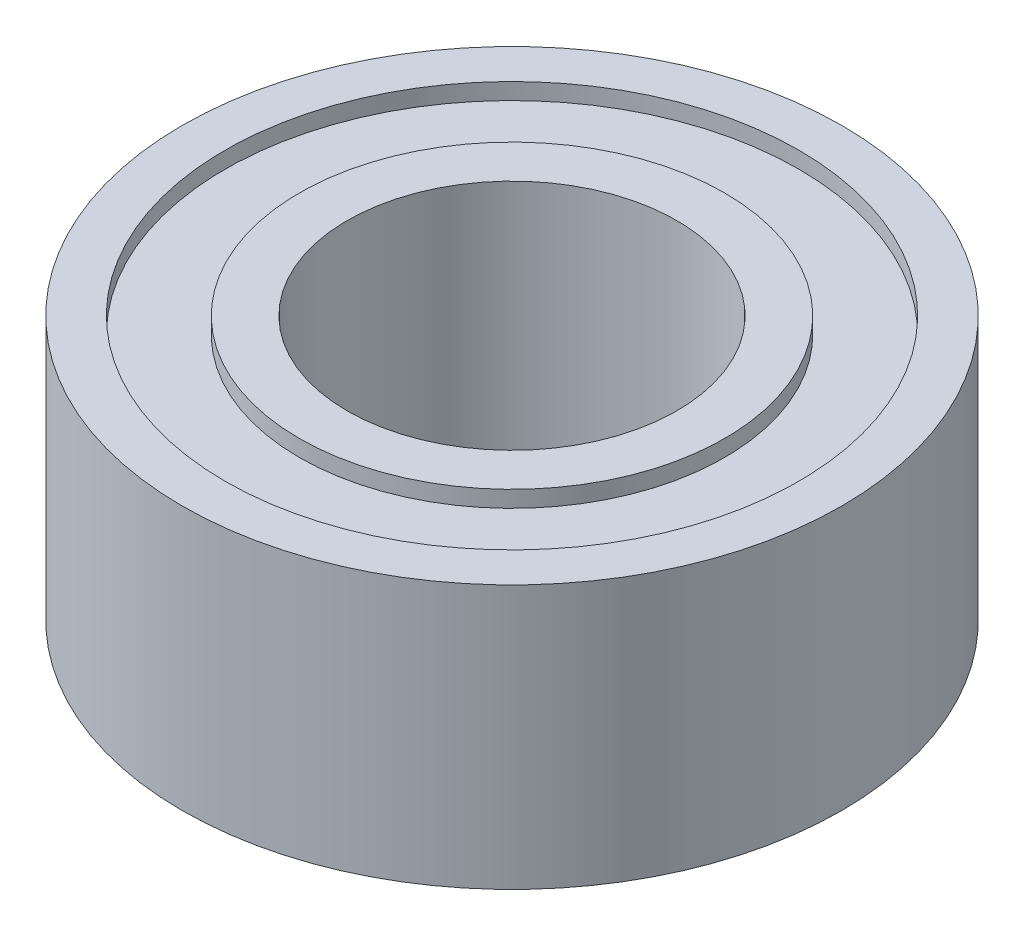
ISO-10303-21;
HEADER;
FILE_DESCRIPTION(('STEP AP214'),'2;1');
FILE_NAME('part.step','',(''),(''),'','','');
FILE_SCHEMA(('AUTOMOTIVE_DESIGN { 1 0 10303 214 1 1 1 1 }'));
ENDSEC;
DATA;
#1=APPLICATION_CONTEXT('core data for automotive mechanical design processes');
#2=APPLICATION_PROTOCOL_DEFINITION('international standard','automotive_design',2000,#1);
#3=PRODUCT_CONTEXT('',#1,'mechanical');
#4=PRODUCT('Part','Part','',(#3));
#5=PRODUCT_RELATED_PRODUCT_CATEGORY('part','',(#4));
#6=PRODUCT_DEFINITION_FORMATION('','',#4);
#7=PRODUCT_DEFINITION_CONTEXT('part definition',#1,'design');
#8=PRODUCT_DEFINITION('design','',#6,#7);
#9=PRODUCT_DEFINITION_SHAPE('','',#8);
#10=(LENGTH_UNIT() NAMED_UNIT(*) SI_UNIT(.MILLI.,.METRE.));
#11=(NAMED_UNIT(*) PLANE_ANGLE_UNIT() SI_UNIT($,.RADIAN.));
#12=(NAMED_UNIT(*) SI_UNIT($,.STERADIAN.) SOLID_ANGLE_UNIT());
#13=UNCERTAINTY_MEASURE_WITH_UNIT(LENGTH_MEASURE(1.E-05),#10,'distance_accuracy_value','');
#14=(GEOMETRIC_REPRESENTATION_CONTEXT(3) GLOBAL_UNCERTAINTY_ASSIGNED_CONTEXT((#13)) GLOBAL_UNIT_ASSIGNED_CONTEXT((#10,
#11,#12)) REPRESENTATION_CONTEXT('',''));
#15=CARTESIAN_POINT('',(0.,0.,0.));
#16=DIRECTION('',(0.,0.,1.));
#17=DIRECTION('',(1.,0.,0.));
#18=AXIS2_PLACEMENT_3D('',#15,#16,#17);
#19=CARTESIAN_POINT('',(0.,0.,0.));
#20=DIRECTION('',(0.,1.,0.));
#21=DIRECTION('',(0.,0.,1.));
#22=AXIS2_PLACEMENT_3D('',#19,#20,#21);
#23=PLANE('',#22);
#24=CARTESIAN_POINT('',(0.,0.,0.));
#25=DIRECTION('',(0.,1.,0.));
#26=DIRECTION('',(0.,0.,1.));
#27=AXIS2_PLACEMENT_3D('',#24,#25,#26);
#28=CIRCLE('',#27,2.5);
#29=CARTESIAN_POINT('',(0.,0.,2.5));
#30=VERTEX_POINT('',#29);
#31=EDGE_CURVE('E52',#30,#30,#28,.T.);
#32=ORIENTED_EDGE('',*,*,#31,.T.);
#33=EDGE_LOOP('',(#32));
#34=FACE_BOUND('',#33,.T.);
#35=CARTESIAN_POINT('',(0.,0.,0.));
#36=DIRECTION('',(0.,-1.,0.));
#37=DIRECTION('',(0.,0.,-1.));
#38=AXIS2_PLACEMENT_3D('',#35,#36,#37);
#39=CIRCLE('',#38,3.225);
#40=CARTESIAN_POINT('',(0.,0.,-3.225));
#41=VERTEX_POINT('',#40);
#42=EDGE_CURVE('E84',#41,#41,#39,.T.);
#43=ORIENTED_EDGE('',*,*,#42,.T.);
#44=EDGE_LOOP('',(#43));
#45=FACE_BOUND('',#44,.T.);
#46=ADVANCED_FACE('F37',(#34,#45),#23,.F.);
#47=CARTESIAN_POINT('',(0.,4.,0.));
#48=DIRECTION('',(0.,1.,0.));
#49=DIRECTION('',(0.,0.,1.));
#50=AXIS2_PLACEMENT_3D('',#47,#48,#49);
#51=PLANE('',#50);
#52=CARTESIAN_POINT('',(0.,4.,0.));
#53=DIRECTION('',(0.,1.,0.));
#54=DIRECTION('',(0.,0.,1.));
#55=AXIS2_PLACEMENT_3D('',#52,#53,#54);
#56=CIRCLE('',#55,2.5);
#57=CARTESIAN_POINT('',(0.,4.,2.5));
#58=VERTEX_POINT('',#57);
#59=EDGE_CURVE('E50',#58,#58,#56,.T.);
#60=ORIENTED_EDGE('',*,*,#59,.F.);
#61=EDGE_LOOP('',(#60));
#62=FACE_BOUND('',#61,.T.);
#63=CARTESIAN_POINT('',(0.,4.,0.));
#64=DIRECTION('',(0.,1.,0.));
#65=DIRECTION('',(0.,0.,1.));
#66=AXIS2_PLACEMENT_3D('',#63,#64,#65);
#67=CIRCLE('',#66,3.225);
#68=CARTESIAN_POINT('',(0.,4.,3.225));
#69=VERTEX_POINT('',#68);
#70=EDGE_CURVE('E68',#69,#69,#67,.T.);
#71=ORIENTED_EDGE('',*,*,#70,.T.);
#72=EDGE_LOOP('',(#71));
#73=FACE_BOUND('',#72,.T.);
#74=ADVANCED_FACE('F124',(#62,#73),#51,.T.);
#75=CARTESIAN_POINT('',(0.,4.,0.));
#76=DIRECTION('',(0.,1.,0.));
#77=DIRECTION('',(0.,0.,1.));
#78=AXIS2_PLACEMENT_3D('',#75,#76,#77);
#79=CIRCLE('',#78,4.35);
#80=CARTESIAN_POINT('',(0.,4.,4.35));
#81=VERTEX_POINT('',#80);
#82=EDGE_CURVE('E60',#81,#81,#79,.T.);
#83=ORIENTED_EDGE('',*,*,#82,.F.);
#84=EDGE_LOOP('',(#83));
#85=FACE_BOUND('',#84,.T.);
#86=CARTESIAN_POINT('',(0.,4.,0.));
#87=DIRECTION('',(0.,1.,0.));
#88=DIRECTION('',(0.,0.,1.));
#89=AXIS2_PLACEMENT_3D('',#86,#87,#88);
#90=CIRCLE('',#89,5.);
#91=CARTESIAN_POINT('',(0.,4.,5.));
#92=VERTEX_POINT('',#91);
#93=EDGE_CURVE('E10',#92,#92,#90,.T.);
#94=ORIENTED_EDGE('',*,*,#93,.T.);
#95=EDGE_LOOP('',(#94));
#96=FACE_BOUND('',#95,.T.);
#97=ADVANCED_FACE('F111',(#85,#96),#51,.T.);
#98=CARTESIAN_POINT('',(0.,0.,0.));
#99=DIRECTION('',(0.,-1.,0.));
#100=DIRECTION('',(0.,0.,-1.));
#101=AXIS2_PLACEMENT_3D('',#98,#99,#100);
#102=CIRCLE('',#101,4.35);
#103=CARTESIAN_POINT('',(0.,0.,-4.35));
#104=VERTEX_POINT('',#103);
#105=EDGE_CURVE('E76',#104,#104,#102,.T.);
#106=ORIENTED_EDGE('',*,*,#105,.F.);
#107=EDGE_LOOP('',(#106));
#108=FACE_BOUND('',#107,.T.);
#109=CARTESIAN_POINT('',(0.,0.,0.));
#110=DIRECTION('',(0.,1.,0.));
#111=DIRECTION('',(0.,0.,1.));
#112=AXIS2_PLACEMENT_3D('',#109,#110,#111);
#113=CIRCLE('',#112,5.);
#114=CARTESIAN_POINT('',(0.,0.,5.));
#115=VERTEX_POINT('',#114);
#116=EDGE_CURVE('E41',#115,#115,#113,.T.);
#117=ORIENTED_EDGE('',*,*,#116,.F.);
#118=EDGE_LOOP('',(#117));
#119=FACE_BOUND('',#118,.T.);
#120=ADVANCED_FACE('F108',(#108,#119),#23,.F.);
#121=CARTESIAN_POINT('',(0.,4.,0.));
#122=DIRECTION('',(0.,-1.,0.));
#123=DIRECTION('',(0.,0.,-1.));
#124=AXIS2_PLACEMENT_3D('',#121,#122,#123);
#125=CYLINDRICAL_SURFACE('',#124,5.);
#126=ORIENTED_EDGE('',*,*,#93,.F.);
#127=EDGE_LOOP('',(#126));
#128=FACE_BOUND('',#127,.T.);
#129=ORIENTED_EDGE('',*,*,#116,.T.);
#130=EDGE_LOOP('',(#129));
#131=FACE_BOUND('',#130,.T.);
#132=ADVANCED_FACE('F39',(#128,#131),#125,.T.);
#133=CARTESIAN_POINT('',(0.,4.,0.));
#134=DIRECTION('',(0.,-1.,0.));
#135=DIRECTION('',(0.,0.,-1.));
#136=AXIS2_PLACEMENT_3D('',#133,#134,#135);
#137=CYLINDRICAL_SURFACE('',#136,2.5);
#138=ORIENTED_EDGE('',*,*,#59,.T.);
#139=EDGE_LOOP('',(#138));
#140=FACE_BOUND('',#139,.T.);
#141=ORIENTED_EDGE('',*,*,#31,.F.);
#142=EDGE_LOOP('',(#141));
#143=FACE_BOUND('',#142,.T.);
#144=ADVANCED_FACE('F115',(#140,#143),#137,.F.);
#145=CARTESIAN_POINT('',(0.,3.75,0.));
#146=DIRECTION('',(0.,1.,0.));
#147=DIRECTION('',(0.,0.,1.));
#148=AXIS2_PLACEMENT_3D('',#145,#146,#147);
#149=CYLINDRICAL_SURFACE('',#148,4.35);
#150=CARTESIAN_POINT('',(0.,3.75,0.));
#151=DIRECTION('',(0.,1.,0.));
#152=DIRECTION('',(0.,0.,1.));
#153=AXIS2_PLACEMENT_3D('',#150,#151,#152);
#154=CIRCLE('',#153,4.35);
#155=CARTESIAN_POINT('',(0.,3.75,4.35));
#156=VERTEX_POINT('',#155);
#157=EDGE_CURVE('E56',#156,#156,#154,.T.);
#158=ORIENTED_EDGE('',*,*,#157,.F.);
#159=EDGE_LOOP('',(#158));
#160=FACE_BOUND('',#159,.T.);
#161=ORIENTED_EDGE('',*,*,#82,.T.);
#162=EDGE_LOOP('',(#161));
#163=FACE_BOUND('',#162,.T.);
#164=ADVANCED_FACE('F120',(#160,#163),#149,.F.);
#165=CARTESIAN_POINT('',(0.,3.75,0.));
#166=DIRECTION('',(0.,1.,0.));
#167=DIRECTION('',(0.,0.,1.));
#168=AXIS2_PLACEMENT_3D('',#165,#166,#167);
#169=PLANE('',#168);
#170=CARTESIAN_POINT('',(0.,3.75,0.));
#171=DIRECTION('',(0.,1.,0.));
#172=DIRECTION('',(0.,0.,1.));
#173=AXIS2_PLACEMENT_3D('',#170,#171,#172);
#174=CIRCLE('',#173,3.225);
#175=CARTESIAN_POINT('',(0.,3.75,3.225));
#176=VERTEX_POINT('',#175);
#177=EDGE_CURVE('E64',#176,#176,#174,.T.);
#178=ORIENTED_EDGE('',*,*,#177,.F.);
#179=EDGE_LOOP('',(#178));
#180=FACE_BOUND('',#179,.T.);
#181=ORIENTED_EDGE('',*,*,#157,.T.);
#182=EDGE_LOOP('',(#181));
#183=FACE_BOUND('',#182,.T.);
#184=ADVANCED_FACE('F137',(#180,#183),#169,.T.);
#185=CARTESIAN_POINT('',(0.,3.75,0.));
#186=DIRECTION('',(0.,1.,0.));
#187=DIRECTION('',(0.,0.,1.));
#188=AXIS2_PLACEMENT_3D('',#185,#186,#187);
#189=CYLINDRICAL_SURFACE('',#188,3.225);
#190=ORIENTED_EDGE('',*,*,#177,.T.);
#191=EDGE_LOOP('',(#190));
#192=FACE_BOUND('',#191,.T.);
#193=ORIENTED_EDGE('',*,*,#70,.F.);
#194=EDGE_LOOP('',(#193));
#195=FACE_BOUND('',#194,.T.);
#196=ADVANCED_FACE('F104',(#192,#195),#189,.T.);
#197=CARTESIAN_POINT('',(0.,0.25,0.));
#198=DIRECTION('',(0.,-1.,0.));
#199=DIRECTION('',(0.,0.,-1.));
#200=AXIS2_PLACEMENT_3D('',#197,#198,#199);
#201=CYLINDRICAL_SURFACE('',#200,4.35);
#202=CARTESIAN_POINT('',(0.,0.25,0.));
#203=DIRECTION('',(0.,-1.,0.));
#204=DIRECTION('',(0.,0.,-1.));
#205=AXIS2_PLACEMENT_3D('',#202,#203,#204);
#206=CIRCLE('',#205,4.35);
#207=CARTESIAN_POINT('',(0.,0.25,-4.35));
#208=VERTEX_POINT('',#207);
#209=EDGE_CURVE('E72',#208,#208,#206,.T.);
#210=ORIENTED_EDGE('',*,*,#209,.F.);
#211=EDGE_LOOP('',(#210));
#212=FACE_BOUND('',#211,.T.);
#213=ORIENTED_EDGE('',*,*,#105,.T.);
#214=EDGE_LOOP('',(#213));
#215=FACE_BOUND('',#214,.T.);
#216=ADVANCED_FACE('F98',(#212,#215),#201,.F.);
#217=CARTESIAN_POINT('',(0.,0.25,0.));
#218=DIRECTION('',(0.,-1.,0.));
#219=DIRECTION('',(0.,0.,-1.));
#220=AXIS2_PLACEMENT_3D('',#217,#218,#219);
#221=PLANE('',#220);
#222=CARTESIAN_POINT('',(0.,0.25,0.));
#223=DIRECTION('',(0.,-1.,0.));
#224=DIRECTION('',(0.,0.,-1.));
#225=AXIS2_PLACEMENT_3D('',#222,#223,#224);
#226=CIRCLE('',#225,3.225);
#227=CARTESIAN_POINT('',(0.,0.25,-3.225));
#228=VERTEX_POINT('',#227);
#229=EDGE_CURVE('E80',#228,#228,#226,.T.);
#230=ORIENTED_EDGE('',*,*,#229,.F.);
#231=EDGE_LOOP('',(#230));
#232=FACE_BOUND('',#231,.T.);
#233=ORIENTED_EDGE('',*,*,#209,.T.);
#234=EDGE_LOOP('',(#233));
#235=FACE_BOUND('',#234,.T.);
#236=ADVANCED_FACE('F95',(#232,#235),#221,.T.);
#237=CARTESIAN_POINT('',(0.,0.25,0.));
#238=DIRECTION('',(0.,-1.,0.));
#239=DIRECTION('',(0.,0.,-1.));
#240=AXIS2_PLACEMENT_3D('',#237,#238,#239);
#241=CYLINDRICAL_SURFACE('',#240,3.225);
#242=ORIENTED_EDGE('',*,*,#229,.T.);
#243=EDGE_LOOP('',(#242));
#244=FACE_BOUND('',#243,.T.);
#245=ORIENTED_EDGE('',*,*,#42,.F.);
#246=EDGE_LOOP('',(#245));
#247=FACE_BOUND('',#246,.T.);
#248=ADVANCED_FACE('F92',(#244,#247),#241,.T.);
#249=CLOSED_SHELL('',(#46,#74,#97,#120,#132,#144,#164,#184,#196,#216,#236,#248));
#250=MANIFOLD_SOLID_BREP('B2',#249);
#251=ADVANCED_BREP_SHAPE_REPRESENTATION('',(#18,#250),#14);
#252=SHAPE_DEFINITION_REPRESENTATION(#9,#251);
ENDSEC;
END-ISO-10303-21;
